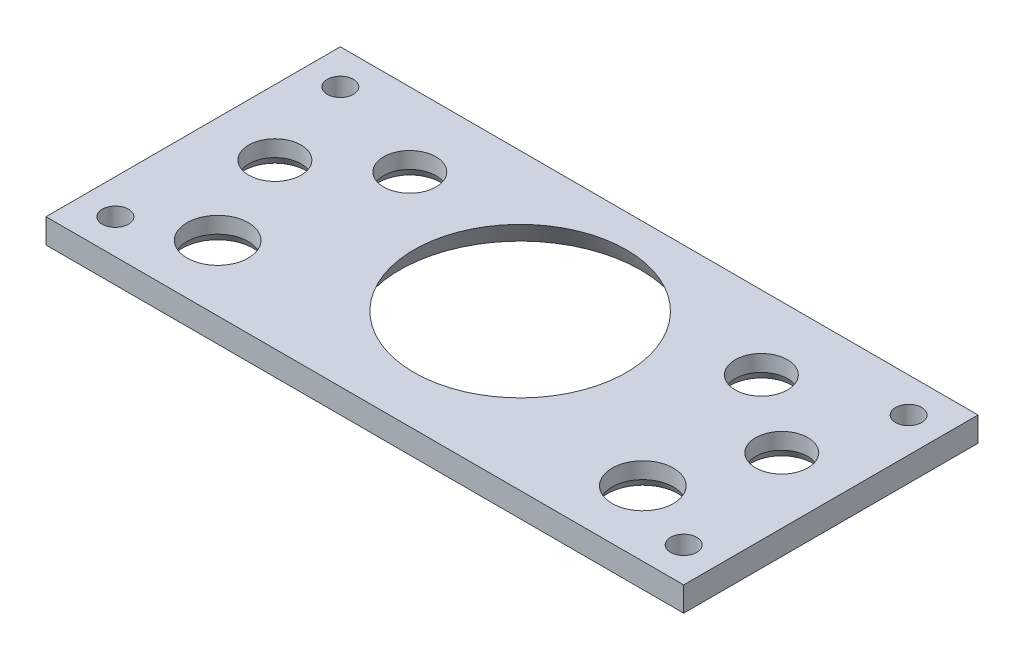
ISO-10303-21;
HEADER;
FILE_DESCRIPTION(('STEP AP214'),'2;1');
FILE_NAME('part.step','',(''),(''),'','','');
FILE_SCHEMA(('AUTOMOTIVE_DESIGN { 1 0 10303 214 1 1 1 1 }'));
ENDSEC;
DATA;
#1=APPLICATION_CONTEXT('core data for automotive mechanical design processes');
#2=APPLICATION_PROTOCOL_DEFINITION('international standard','automotive_design',2000,#1);
#3=PRODUCT_CONTEXT('',#1,'mechanical');
#4=PRODUCT('Part','Part','',(#3));
#5=PRODUCT_RELATED_PRODUCT_CATEGORY('part','',(#4));
#6=PRODUCT_DEFINITION_FORMATION('','',#4);
#7=PRODUCT_DEFINITION_CONTEXT('part definition',#1,'design');
#8=PRODUCT_DEFINITION('design','',#6,#7);
#9=PRODUCT_DEFINITION_SHAPE('','',#8);
#10=(LENGTH_UNIT() NAMED_UNIT(*) SI_UNIT(.MILLI.,.METRE.));
#11=(NAMED_UNIT(*) PLANE_ANGLE_UNIT() SI_UNIT($,.RADIAN.));
#12=(NAMED_UNIT(*) SI_UNIT($,.STERADIAN.) SOLID_ANGLE_UNIT());
#13=UNCERTAINTY_MEASURE_WITH_UNIT(LENGTH_MEASURE(1.E-05),#10,'distance_accuracy_value','');
#14=(GEOMETRIC_REPRESENTATION_CONTEXT(3) GLOBAL_UNCERTAINTY_ASSIGNED_CONTEXT((#13)) GLOBAL_UNIT_ASSIGNED_CONTEXT((#10,
#11,#12)) REPRESENTATION_CONTEXT('',''));
#15=CARTESIAN_POINT('',(0.,0.,0.));
#16=DIRECTION('',(0.,0.,1.));
#17=DIRECTION('',(1.,0.,0.));
#18=AXIS2_PLACEMENT_3D('',#15,#16,#17);
#19=CARTESIAN_POINT('',(0.,3.,0.));
#20=DIRECTION('',(0.,1.,0.));
#21=DIRECTION('',(0.,0.,1.));
#22=AXIS2_PLACEMENT_3D('',#19,#20,#21);
#23=PLANE('',#22);
#24=CARTESIAN_POINT('',(-34.7573593128807,3.,-13.7573593128806));
#25=DIRECTION('',(0.,1.,0.));
#26=DIRECTION('',(0.,0.,1.));
#27=AXIS2_PLACEMENT_3D('',#24,#25,#26);
#28=CIRCLE('',#27,1.6);
#29=CARTESIAN_POINT('',(-34.7573593128807,3.,-12.1573593128806));
#30=VERTEX_POINT('',#29);
#31=EDGE_CURVE('E228',#30,#30,#28,.T.);
#32=ORIENTED_EDGE('',*,*,#31,.F.);
#33=EDGE_LOOP('',(#32));
#34=FACE_BOUND('',#33,.T.);
#35=CARTESIAN_POINT('',(34.7573593128807,3.,-13.7573593128806));
#36=DIRECTION('',(0.,1.,0.));
#37=DIRECTION('',(0.,0.,1.));
#38=AXIS2_PLACEMENT_3D('',#35,#36,#37);
#39=CIRCLE('',#38,1.6);
#40=CARTESIAN_POINT('',(34.7573593128807,3.,-12.1573593128807));
#41=VERTEX_POINT('',#40);
#42=EDGE_CURVE('E234',#41,#41,#39,.T.);
#43=ORIENTED_EDGE('',*,*,#42,.F.);
#44=EDGE_LOOP('',(#43));
#45=FACE_BOUND('',#44,.T.);
#46=CARTESIAN_POINT('',(34.7573593128807,3.,13.7573593128807));
#47=DIRECTION('',(0.,1.,0.));
#48=DIRECTION('',(0.,0.,1.));
#49=AXIS2_PLACEMENT_3D('',#46,#47,#48);
#50=CIRCLE('',#49,1.6);
#51=CARTESIAN_POINT('',(34.7573593128807,3.,15.3573593128807));
#52=VERTEX_POINT('',#51);
#53=EDGE_CURVE('E242',#52,#52,#50,.T.);
#54=ORIENTED_EDGE('',*,*,#53,.F.);
#55=EDGE_LOOP('',(#54));
#56=FACE_BOUND('',#55,.T.);
#57=CARTESIAN_POINT('',(-34.7573593128807,3.,13.7573593128807));
#58=DIRECTION('',(0.,1.,0.));
#59=DIRECTION('',(0.,0.,1.));
#60=AXIS2_PLACEMENT_3D('',#57,#58,#59);
#61=CIRCLE('',#60,1.6);
#62=CARTESIAN_POINT('',(-34.7573593128807,3.,15.3573593128807));
#63=VERTEX_POINT('',#62);
#64=EDGE_CURVE('E231',#63,#63,#61,.T.);
#65=ORIENTED_EDGE('',*,*,#64,.F.);
#66=EDGE_LOOP('',(#65));
#67=FACE_BOUND('',#66,.T.);
#68=CARTESIAN_POINT('',(21.5,3.,-9.));
#69=DIRECTION('',(0.,1.,0.));
#70=DIRECTION('',(0.,0.,1.));
#71=AXIS2_PLACEMENT_3D('',#68,#69,#70);
#72=CIRCLE('',#71,3.2);
#73=CARTESIAN_POINT('',(21.5,3.,-5.8));
#74=VERTEX_POINT('',#73);
#75=EDGE_CURVE('E253',#74,#74,#72,.T.);
#76=ORIENTED_EDGE('',*,*,#75,.F.);
#77=EDGE_LOOP('',(#76));
#78=FACE_BOUND('',#77,.T.);
#79=CARTESIAN_POINT('',(26.,3.,10.));
#80=DIRECTION('',(0.,1.,0.));
#81=DIRECTION('',(0.,0.,1.));
#82=AXIS2_PLACEMENT_3D('',#79,#80,#81);
#83=CIRCLE('',#82,3.75000000000001);
#84=CARTESIAN_POINT('',(26.,3.,13.75));
#85=VERTEX_POINT('',#84);
#86=EDGE_CURVE('E259',#85,#85,#83,.T.);
#87=ORIENTED_EDGE('',*,*,#86,.F.);
#88=EDGE_LOOP('',(#87));
#89=FACE_BOUND('',#88,.T.);
#90=CARTESIAN_POINT('',(-26.,3.,10.));
#91=DIRECTION('',(0.,1.,0.));
#92=DIRECTION('',(0.,0.,1.));
#93=AXIS2_PLACEMENT_3D('',#90,#91,#92);
#94=CIRCLE('',#93,3.75);
#95=CARTESIAN_POINT('',(-26.,3.,13.75));
#96=VERTEX_POINT('',#95);
#97=EDGE_CURVE('E265',#96,#96,#94,.T.);
#98=ORIENTED_EDGE('',*,*,#97,.F.);
#99=EDGE_LOOP('',(#98));
#100=FACE_BOUND('',#99,.T.);
#101=DIRECTION('',(0.,0.,1.));
#102=VECTOR('',#101,1.);
#103=CARTESIAN_POINT('',(-39.,3.,18.));
#104=LINE('',#103,#102);
#105=CARTESIAN_POINT('',(-39.,3.,-18.));
#106=VERTEX_POINT('',#105);
#107=CARTESIAN_POINT('',(-39.,3.,18.));
#108=VERTEX_POINT('',#107);
#109=EDGE_CURVE('E87',#106,#108,#104,.T.);
#110=ORIENTED_EDGE('',*,*,#109,.T.);
#111=DIRECTION('',(1.,0.,0.));
#112=VECTOR('',#111,1.);
#113=CARTESIAN_POINT('',(39.,3.,18.));
#114=LINE('',#113,#112);
#115=CARTESIAN_POINT('',(39.,3.,18.));
#116=VERTEX_POINT('',#115);
#117=EDGE_CURVE('E82',#108,#116,#114,.T.);
#118=ORIENTED_EDGE('',*,*,#117,.T.);
#119=DIRECTION('',(0.,0.,-1.));
#120=VECTOR('',#119,1.);
#121=CARTESIAN_POINT('',(39.,3.,18.));
#122=LINE('',#121,#120);
#123=CARTESIAN_POINT('',(39.,3.,-18.));
#124=VERTEX_POINT('',#123);
#125=EDGE_CURVE('E85',#116,#124,#122,.T.);
#126=ORIENTED_EDGE('',*,*,#125,.T.);
#127=DIRECTION('',(-1.,0.,0.));
#128=VECTOR('',#127,1.);
#129=CARTESIAN_POINT('',(39.,3.,-18.));
#130=LINE('',#129,#128);
#131=EDGE_CURVE('E51',#124,#106,#130,.T.);
#132=ORIENTED_EDGE('',*,*,#131,.T.);
#133=EDGE_LOOP('',(#110,#118,#126,#132));
#134=FACE_BOUND('',#133,.T.);
#135=CARTESIAN_POINT('',(-31.,3.,-2.));
#136=DIRECTION('',(0.,1.,0.));
#137=DIRECTION('',(0.,0.,1.));
#138=AXIS2_PLACEMENT_3D('',#135,#136,#137);
#139=CIRCLE('',#138,3.2);
#140=CARTESIAN_POINT('',(-31.,3.,1.2));
#141=VERTEX_POINT('',#140);
#142=EDGE_CURVE('E105',#141,#141,#139,.T.);
#143=ORIENTED_EDGE('',*,*,#142,.F.);
#144=EDGE_LOOP('',(#143));
#145=FACE_BOUND('',#144,.T.);
#146=CARTESIAN_POINT('',(31.,3.,-2.));
#147=DIRECTION('',(0.,1.,0.));
#148=DIRECTION('',(0.,0.,1.));
#149=AXIS2_PLACEMENT_3D('',#146,#147,#148);
#150=CIRCLE('',#149,3.20000000000001);
#151=CARTESIAN_POINT('',(31.,3.,1.20000000000001));
#152=VERTEX_POINT('',#151);
#153=EDGE_CURVE('E262',#152,#152,#150,.T.);
#154=ORIENTED_EDGE('',*,*,#153,.F.);
#155=EDGE_LOOP('',(#154));
#156=FACE_BOUND('',#155,.T.);
#157=CARTESIAN_POINT('',(0.,3.,-1.));
#158=DIRECTION('',(0.,1.,0.));
#159=DIRECTION('',(0.,0.,1.));
#160=AXIS2_PLACEMENT_3D('',#157,#158,#159);
#161=CIRCLE('',#160,13.);
#162=CARTESIAN_POINT('',(0.,3.,12.));
#163=VERTEX_POINT('',#162);
#164=EDGE_CURVE('E256',#163,#163,#161,.T.);
#165=ORIENTED_EDGE('',*,*,#164,.F.);
#166=EDGE_LOOP('',(#165));
#167=FACE_BOUND('',#166,.T.);
#168=CARTESIAN_POINT('',(-21.5,3.,-9.));
#169=DIRECTION('',(0.,1.,0.));
#170=DIRECTION('',(0.,0.,1.));
#171=AXIS2_PLACEMENT_3D('',#168,#169,#170);
#172=CIRCLE('',#171,3.2);
#173=CARTESIAN_POINT('',(-21.5,3.,-5.8));
#174=VERTEX_POINT('',#173);
#175=EDGE_CURVE('E248',#174,#174,#172,.T.);
#176=ORIENTED_EDGE('',*,*,#175,.F.);
#177=EDGE_LOOP('',(#176));
#178=FACE_BOUND('',#177,.T.);
#179=ADVANCED_FACE('F34',(#34,#45,#56,#67,#78,#89,#100,#134,#145,#156,#167,#178),#23,.T.);
#180=CARTESIAN_POINT('',(0.,0.,0.));
#181=DIRECTION('',(0.,1.,0.));
#182=DIRECTION('',(0.,0.,1.));
#183=AXIS2_PLACEMENT_3D('',#180,#181,#182);
#184=PLANE('',#183);
#185=CARTESIAN_POINT('',(-34.7573593128807,0.,-13.7573593128806));
#186=DIRECTION('',(0.,1.,0.));
#187=DIRECTION('',(0.,0.,1.));
#188=AXIS2_PLACEMENT_3D('',#185,#186,#187);
#189=CIRCLE('',#188,1.6);
#190=CARTESIAN_POINT('',(-34.7573593128807,0.,-12.1573593128806));
#191=VERTEX_POINT('',#190);
#192=EDGE_CURVE('E226',#191,#191,#189,.T.);
#193=ORIENTED_EDGE('',*,*,#192,.T.);
#194=EDGE_LOOP('',(#193));
#195=FACE_BOUND('',#194,.T.);
#196=CARTESIAN_POINT('',(34.7573593128807,0.,-13.7573593128806));
#197=DIRECTION('',(0.,1.,0.));
#198=DIRECTION('',(0.,0.,1.));
#199=AXIS2_PLACEMENT_3D('',#196,#197,#198);
#200=CIRCLE('',#199,1.6);
#201=CARTESIAN_POINT('',(34.7573593128807,0.,-12.1573593128807));
#202=VERTEX_POINT('',#201);
#203=EDGE_CURVE('E229',#202,#202,#200,.T.);
#204=ORIENTED_EDGE('',*,*,#203,.T.);
#205=EDGE_LOOP('',(#204));
#206=FACE_BOUND('',#205,.T.);
#207=CARTESIAN_POINT('',(34.7573593128807,0.,13.7573593128807));
#208=DIRECTION('',(0.,1.,0.));
#209=DIRECTION('',(0.,0.,1.));
#210=AXIS2_PLACEMENT_3D('',#207,#208,#209);
#211=CIRCLE('',#210,1.6);
#212=CARTESIAN_POINT('',(34.7573593128807,0.,15.3573593128807));
#213=VERTEX_POINT('',#212);
#214=EDGE_CURVE('E239',#213,#213,#211,.T.);
#215=ORIENTED_EDGE('',*,*,#214,.T.);
#216=EDGE_LOOP('',(#215));
#217=FACE_BOUND('',#216,.T.);
#218=CARTESIAN_POINT('',(-34.7573593128807,0.,13.7573593128807));
#219=DIRECTION('',(0.,1.,0.));
#220=DIRECTION('',(0.,0.,1.));
#221=AXIS2_PLACEMENT_3D('',#218,#219,#220);
#222=CIRCLE('',#221,1.6);
#223=CARTESIAN_POINT('',(-34.7573593128807,0.,15.3573593128807));
#224=VERTEX_POINT('',#223);
#225=EDGE_CURVE('E245',#224,#224,#222,.T.);
#226=ORIENTED_EDGE('',*,*,#225,.T.);
#227=EDGE_LOOP('',(#226));
#228=FACE_BOUND('',#227,.T.);
#229=CARTESIAN_POINT('',(-26.,0.,10.));
#230=DIRECTION('',(0.,1.,0.));
#231=DIRECTION('',(0.,0.,1.));
#232=AXIS2_PLACEMENT_3D('',#229,#230,#231);
#233=CIRCLE('',#232,4.32735026918962);
#234=CARTESIAN_POINT('',(-26.,0.,14.3273502691896));
#235=VERTEX_POINT('',#234);
#236=EDGE_CURVE('E130',#235,#235,#233,.T.);
#237=ORIENTED_EDGE('',*,*,#236,.T.);
#238=EDGE_LOOP('',(#237));
#239=FACE_BOUND('',#238,.T.);
#240=CARTESIAN_POINT('',(-21.5,0.,-9.));
#241=DIRECTION('',(0.,1.,0.));
#242=DIRECTION('',(0.,0.,1.));
#243=AXIS2_PLACEMENT_3D('',#240,#241,#242);
#244=CIRCLE('',#243,3.77735026918964);
#245=CARTESIAN_POINT('',(-21.5,0.,-5.22264973081036));
#246=VERTEX_POINT('',#245);
#247=EDGE_CURVE('E127',#246,#246,#244,.T.);
#248=ORIENTED_EDGE('',*,*,#247,.T.);
#249=EDGE_LOOP('',(#248));
#250=FACE_BOUND('',#249,.T.);
#251=CARTESIAN_POINT('',(21.5,0.,-9.));
#252=DIRECTION('',(0.,1.,0.));
#253=DIRECTION('',(0.,0.,1.));
#254=AXIS2_PLACEMENT_3D('',#251,#252,#253);
#255=CIRCLE('',#254,3.77735026918964);
#256=CARTESIAN_POINT('',(21.5,0.,-5.22264973081036));
#257=VERTEX_POINT('',#256);
#258=EDGE_CURVE('E124',#257,#257,#255,.T.);
#259=ORIENTED_EDGE('',*,*,#258,.T.);
#260=EDGE_LOOP('',(#259));
#261=FACE_BOUND('',#260,.T.);
#262=CARTESIAN_POINT('',(-31.,0.,-2.));
#263=DIRECTION('',(0.,1.,0.));
#264=DIRECTION('',(0.,0.,1.));
#265=AXIS2_PLACEMENT_3D('',#262,#263,#264);
#266=CIRCLE('',#265,3.77735026918964);
#267=CARTESIAN_POINT('',(-31.,0.,1.77735026918964));
#268=VERTEX_POINT('',#267);
#269=EDGE_CURVE('E121',#268,#268,#266,.T.);
#270=ORIENTED_EDGE('',*,*,#269,.T.);
#271=EDGE_LOOP('',(#270));
#272=FACE_BOUND('',#271,.T.);
#273=CARTESIAN_POINT('',(31.,0.,-2.));
#274=DIRECTION('',(0.,1.,0.));
#275=DIRECTION('',(0.,0.,1.));
#276=AXIS2_PLACEMENT_3D('',#273,#274,#275);
#277=CIRCLE('',#276,3.77735026918964);
#278=CARTESIAN_POINT('',(31.,0.,1.77735026918964));
#279=VERTEX_POINT('',#278);
#280=EDGE_CURVE('E118',#279,#279,#277,.T.);
#281=ORIENTED_EDGE('',*,*,#280,.T.);
#282=EDGE_LOOP('',(#281));
#283=FACE_BOUND('',#282,.T.);
#284=CARTESIAN_POINT('',(26.,0.,10.));
#285=DIRECTION('',(0.,1.,0.));
#286=DIRECTION('',(0.,0.,1.));
#287=AXIS2_PLACEMENT_3D('',#284,#285,#286);
#288=CIRCLE('',#287,4.32735026918964);
#289=CARTESIAN_POINT('',(26.,0.,14.3273502691896));
#290=VERTEX_POINT('',#289);
#291=EDGE_CURVE('E115',#290,#290,#288,.T.);
#292=ORIENTED_EDGE('',*,*,#291,.T.);
#293=EDGE_LOOP('',(#292));
#294=FACE_BOUND('',#293,.T.);
#295=CARTESIAN_POINT('',(0.,0.,-1.));
#296=DIRECTION('',(0.,1.,0.));
#297=DIRECTION('',(0.,0.,1.));
#298=AXIS2_PLACEMENT_3D('',#295,#296,#297);
#299=CIRCLE('',#298,14.7320508075689);
#300=CARTESIAN_POINT('',(0.,0.,13.7320508075689));
#301=VERTEX_POINT('',#300);
#302=EDGE_CURVE('E112',#301,#301,#299,.T.);
#303=ORIENTED_EDGE('',*,*,#302,.T.);
#304=EDGE_LOOP('',(#303));
#305=FACE_BOUND('',#304,.T.);
#306=DIRECTION('',(0.,0.,1.));
#307=VECTOR('',#306,1.);
#308=CARTESIAN_POINT('',(-39.,0.,18.));
#309=LINE('',#308,#307);
#310=CARTESIAN_POINT('',(-39.,0.,-18.));
#311=VERTEX_POINT('',#310);
#312=CARTESIAN_POINT('',(-39.,0.,18.));
#313=VERTEX_POINT('',#312);
#314=EDGE_CURVE('E102',#311,#313,#309,.T.);
#315=ORIENTED_EDGE('',*,*,#314,.F.);
#316=DIRECTION('',(-1.,0.,0.));
#317=VECTOR('',#316,1.);
#318=CARTESIAN_POINT('',(39.,0.,-18.));
#319=LINE('',#318,#317);
#320=CARTESIAN_POINT('',(39.,0.,-18.));
#321=VERTEX_POINT('',#320);
#322=EDGE_CURVE('E74',#321,#311,#319,.T.);
#323=ORIENTED_EDGE('',*,*,#322,.F.);
#324=DIRECTION('',(0.,0.,-1.));
#325=VECTOR('',#324,1.);
#326=CARTESIAN_POINT('',(39.,0.,18.));
#327=LINE('',#326,#325);
#328=CARTESIAN_POINT('',(39.,0.,18.));
#329=VERTEX_POINT('',#328);
#330=EDGE_CURVE('E68',#329,#321,#327,.T.);
#331=ORIENTED_EDGE('',*,*,#330,.F.);
#332=DIRECTION('',(1.,0.,0.));
#333=VECTOR('',#332,1.);
#334=CARTESIAN_POINT('',(39.,0.,18.));
#335=LINE('',#334,#333);
#336=EDGE_CURVE('E92',#313,#329,#335,.T.);
#337=ORIENTED_EDGE('',*,*,#336,.F.);
#338=EDGE_LOOP('',(#315,#323,#331,#337));
#339=FACE_BOUND('',#338,.T.);
#340=ADVANCED_FACE('F156',(#195,#206,#217,#228,#239,#250,#261,#272,#283,#294,#305,#339),#184,.F.);
#341=CARTESIAN_POINT('',(-39.,3.,18.));
#342=DIRECTION('',(1.,0.,0.));
#343=DIRECTION('',(0.,0.,-1.));
#344=AXIS2_PLACEMENT_3D('',#341,#342,#343);
#345=PLANE('',#344);
#346=ORIENTED_EDGE('',*,*,#314,.T.);
#347=DIRECTION('',(0.,-1.,0.));
#348=VECTOR('',#347,1.);
#349=CARTESIAN_POINT('',(-39.,3.,18.));
#350=LINE('',#349,#348);
#351=EDGE_CURVE('E93',#108,#313,#350,.T.);
#352=ORIENTED_EDGE('',*,*,#351,.F.);
#353=ORIENTED_EDGE('',*,*,#109,.F.);
#354=DIRECTION('',(0.,-1.,0.));
#355=VECTOR('',#354,1.);
#356=CARTESIAN_POINT('',(-39.,3.,-18.));
#357=LINE('',#356,#355);
#358=EDGE_CURVE('E98',#106,#311,#357,.T.);
#359=ORIENTED_EDGE('',*,*,#358,.T.);
#360=EDGE_LOOP('',(#346,#352,#353,#359));
#361=FACE_BOUND('',#360,.T.);
#362=ADVANCED_FACE('F159',(#361),#345,.F.);
#363=CARTESIAN_POINT('',(39.,3.,18.));
#364=DIRECTION('',(0.,0.,-1.));
#365=DIRECTION('',(-1.,0.,0.));
#366=AXIS2_PLACEMENT_3D('',#363,#364,#365);
#367=PLANE('',#366);
#368=ORIENTED_EDGE('',*,*,#336,.T.);
#369=DIRECTION('',(0.,-1.,0.));
#370=VECTOR('',#369,1.);
#371=CARTESIAN_POINT('',(39.,3.,18.));
#372=LINE('',#371,#370);
#373=EDGE_CURVE('E90',#116,#329,#372,.T.);
#374=ORIENTED_EDGE('',*,*,#373,.F.);
#375=ORIENTED_EDGE('',*,*,#117,.F.);
#376=ORIENTED_EDGE('',*,*,#351,.T.);
#377=EDGE_LOOP('',(#368,#374,#375,#376));
#378=FACE_BOUND('',#377,.T.);
#379=ADVANCED_FACE('F91',(#378),#367,.F.);
#380=CARTESIAN_POINT('',(39.,3.,18.));
#381=DIRECTION('',(-1.,0.,0.));
#382=DIRECTION('',(0.,0.,1.));
#383=AXIS2_PLACEMENT_3D('',#380,#381,#382);
#384=PLANE('',#383);
#385=ORIENTED_EDGE('',*,*,#330,.T.);
#386=DIRECTION('',(0.,-1.,0.));
#387=VECTOR('',#386,1.);
#388=CARTESIAN_POINT('',(39.,3.,-18.));
#389=LINE('',#388,#387);
#390=EDGE_CURVE('E94',#124,#321,#389,.T.);
#391=ORIENTED_EDGE('',*,*,#390,.F.);
#392=ORIENTED_EDGE('',*,*,#125,.F.);
#393=ORIENTED_EDGE('',*,*,#373,.T.);
#394=EDGE_LOOP('',(#385,#391,#392,#393));
#395=FACE_BOUND('',#394,.T.);
#396=ADVANCED_FACE('F96',(#395),#384,.F.);
#397=CARTESIAN_POINT('',(39.,3.,-18.));
#398=DIRECTION('',(0.,0.,1.));
#399=DIRECTION('',(1.,0.,0.));
#400=AXIS2_PLACEMENT_3D('',#397,#398,#399);
#401=PLANE('',#400);
#402=ORIENTED_EDGE('',*,*,#322,.T.);
#403=ORIENTED_EDGE('',*,*,#358,.F.);
#404=ORIENTED_EDGE('',*,*,#131,.F.);
#405=ORIENTED_EDGE('',*,*,#390,.T.);
#406=EDGE_LOOP('',(#402,#403,#404,#405));
#407=FACE_BOUND('',#406,.T.);
#408=ADVANCED_FACE('F168',(#407),#401,.F.);
#409=CARTESIAN_POINT('',(-31.,3.,-2.));
#410=DIRECTION('',(0.,-1.,0.));
#411=DIRECTION('',(0.,0.,-1.));
#412=AXIS2_PLACEMENT_3D('',#409,#410,#411);
#413=CYLINDRICAL_SURFACE('',#412,3.2);
#414=CARTESIAN_POINT('',(-31.,1.00000000000002,-2.));
#415=DIRECTION('',(0.,1.,0.));
#416=DIRECTION('',(0.,0.,1.));
#417=AXIS2_PLACEMENT_3D('',#414,#415,#416);
#418=CIRCLE('',#417,3.2);
#419=CARTESIAN_POINT('',(-31.,1.00000000000002,1.2));
#420=VERTEX_POINT('',#419);
#421=EDGE_CURVE('E142',#420,#420,#418,.F.);
#422=ORIENTED_EDGE('',*,*,#421,.T.);
#423=EDGE_LOOP('',(#422));
#424=FACE_BOUND('',#423,.T.);
#425=ORIENTED_EDGE('',*,*,#142,.T.);
#426=EDGE_LOOP('',(#425));
#427=FACE_BOUND('',#426,.T.);
#428=ADVANCED_FACE('F170',(#424,#427),#413,.F.);
#429=CARTESIAN_POINT('',(-26.,3.,10.));
#430=DIRECTION('',(0.,-1.,0.));
#431=DIRECTION('',(0.,0.,-1.));
#432=AXIS2_PLACEMENT_3D('',#429,#430,#431);
#433=CYLINDRICAL_SURFACE('',#432,3.75);
#434=CARTESIAN_POINT('',(-26.,0.999999999999997,10.));
#435=DIRECTION('',(0.,1.,0.));
#436=DIRECTION('',(0.,0.,1.));
#437=AXIS2_PLACEMENT_3D('',#434,#435,#436);
#438=CIRCLE('',#437,3.75);
#439=CARTESIAN_POINT('',(-26.,0.999999999999997,13.75));
#440=VERTEX_POINT('',#439);
#441=EDGE_CURVE('E133',#440,#440,#438,.F.);
#442=ORIENTED_EDGE('',*,*,#441,.T.);
#443=EDGE_LOOP('',(#442));
#444=FACE_BOUND('',#443,.T.);
#445=ORIENTED_EDGE('',*,*,#97,.T.);
#446=EDGE_LOOP('',(#445));
#447=FACE_BOUND('',#446,.T.);
#448=ADVANCED_FACE('F176',(#444,#447),#433,.F.);
#449=CARTESIAN_POINT('',(31.,3.,-2.));
#450=DIRECTION('',(0.,-1.,0.));
#451=DIRECTION('',(0.,0.,-1.));
#452=AXIS2_PLACEMENT_3D('',#449,#450,#451);
#453=CYLINDRICAL_SURFACE('',#452,3.20000000000001);
#454=CARTESIAN_POINT('',(31.,1.00000000000002,-2.));
#455=DIRECTION('',(0.,1.,0.));
#456=DIRECTION('',(0.,0.,1.));
#457=AXIS2_PLACEMENT_3D('',#454,#455,#456);
#458=CIRCLE('',#457,3.20000000000001);
#459=CARTESIAN_POINT('',(31.,1.00000000000002,1.20000000000001));
#460=VERTEX_POINT('',#459);
#461=EDGE_CURVE('E43',#460,#460,#458,.F.);
#462=ORIENTED_EDGE('',*,*,#461,.T.);
#463=EDGE_LOOP('',(#462));
#464=FACE_BOUND('',#463,.T.);
#465=ORIENTED_EDGE('',*,*,#153,.T.);
#466=EDGE_LOOP('',(#465));
#467=FACE_BOUND('',#466,.T.);
#468=ADVANCED_FACE('F147',(#464,#467),#453,.F.);
#469=CARTESIAN_POINT('',(26.,3.,10.));
#470=DIRECTION('',(0.,-1.,0.));
#471=DIRECTION('',(0.,0.,-1.));
#472=AXIS2_PLACEMENT_3D('',#469,#470,#471);
#473=CYLINDRICAL_SURFACE('',#472,3.75000000000001);
#474=CARTESIAN_POINT('',(26.,1.00000000000001,10.));
#475=DIRECTION('',(0.,1.,0.));
#476=DIRECTION('',(0.,0.,1.));
#477=AXIS2_PLACEMENT_3D('',#474,#475,#476);
#478=CIRCLE('',#477,3.75000000000001);
#479=CARTESIAN_POINT('',(26.,1.00000000000001,13.75));
#480=VERTEX_POINT('',#479);
#481=EDGE_CURVE('E11',#480,#480,#478,.F.);
#482=ORIENTED_EDGE('',*,*,#481,.T.);
#483=EDGE_LOOP('',(#482));
#484=FACE_BOUND('',#483,.T.);
#485=ORIENTED_EDGE('',*,*,#86,.T.);
#486=EDGE_LOOP('',(#485));
#487=FACE_BOUND('',#486,.T.);
#488=ADVANCED_FACE('F193',(#484,#487),#473,.F.);
#489=CARTESIAN_POINT('',(21.5,3.,-9.));
#490=DIRECTION('',(0.,-1.,0.));
#491=DIRECTION('',(0.,0.,-1.));
#492=AXIS2_PLACEMENT_3D('',#489,#490,#491);
#493=CYLINDRICAL_SURFACE('',#492,3.2);
#494=CARTESIAN_POINT('',(21.5,1.00000000000002,-9.));
#495=DIRECTION('',(0.,1.,0.));
#496=DIRECTION('',(0.,0.,1.));
#497=AXIS2_PLACEMENT_3D('',#494,#495,#496);
#498=CIRCLE('',#497,3.2);
#499=CARTESIAN_POINT('',(21.5,1.00000000000002,-5.8));
#500=VERTEX_POINT('',#499);
#501=EDGE_CURVE('E139',#500,#500,#498,.F.);
#502=ORIENTED_EDGE('',*,*,#501,.T.);
#503=EDGE_LOOP('',(#502));
#504=FACE_BOUND('',#503,.T.);
#505=ORIENTED_EDGE('',*,*,#75,.T.);
#506=EDGE_LOOP('',(#505));
#507=FACE_BOUND('',#506,.T.);
#508=ADVANCED_FACE('F196',(#504,#507),#493,.F.);
#509=CARTESIAN_POINT('',(-21.5,3.,-9.));
#510=DIRECTION('',(0.,-1.,0.));
#511=DIRECTION('',(0.,0.,-1.));
#512=AXIS2_PLACEMENT_3D('',#509,#510,#511);
#513=CYLINDRICAL_SURFACE('',#512,3.2);
#514=CARTESIAN_POINT('',(-21.5,1.00000000000002,-9.));
#515=DIRECTION('',(0.,1.,0.));
#516=DIRECTION('',(0.,0.,1.));
#517=AXIS2_PLACEMENT_3D('',#514,#515,#516);
#518=CIRCLE('',#517,3.2);
#519=CARTESIAN_POINT('',(-21.5,1.00000000000002,-5.8));
#520=VERTEX_POINT('',#519);
#521=EDGE_CURVE('E136',#520,#520,#518,.F.);
#522=ORIENTED_EDGE('',*,*,#521,.T.);
#523=EDGE_LOOP('',(#522));
#524=FACE_BOUND('',#523,.T.);
#525=ORIENTED_EDGE('',*,*,#175,.T.);
#526=EDGE_LOOP('',(#525));
#527=FACE_BOUND('',#526,.T.);
#528=ADVANCED_FACE('F200',(#524,#527),#513,.F.);
#529=CARTESIAN_POINT('',(0.,0.,-1.));
#530=DIRECTION('',(0.,-1.,0.));
#531=DIRECTION('',(0.,0.,-1.));
#532=AXIS2_PLACEMENT_3D('',#529,#530,#531);
#533=CONICAL_SURFACE('',#532,14.7320508075689,0.523598775598297);
#534=ORIENTED_EDGE('',*,*,#164,.T.);
#535=EDGE_LOOP('',(#534));
#536=FACE_BOUND('',#535,.T.);
#537=ORIENTED_EDGE('',*,*,#302,.F.);
#538=EDGE_LOOP('',(#537));
#539=FACE_BOUND('',#538,.T.);
#540=ADVANCED_FACE('F204',(#536,#539),#533,.F.);
#541=CARTESIAN_POINT('',(-26.,0.,10.));
#542=DIRECTION('',(0.,-1.,0.));
#543=DIRECTION('',(0.,0.,-1.));
#544=AXIS2_PLACEMENT_3D('',#541,#542,#543);
#545=CONICAL_SURFACE('',#544,4.32735026918962,0.523598775598298);
#546=ORIENTED_EDGE('',*,*,#441,.F.);
#547=EDGE_LOOP('',(#546));
#548=FACE_BOUND('',#547,.T.);
#549=ORIENTED_EDGE('',*,*,#236,.F.);
#550=EDGE_LOOP('',(#549));
#551=FACE_BOUND('',#550,.T.);
#552=ADVANCED_FACE('F281',(#548,#551),#545,.F.);
#553=CARTESIAN_POINT('',(-21.5,0.,-9.));
#554=DIRECTION('',(0.,-1.,0.));
#555=DIRECTION('',(0.,0.,-1.));
#556=AXIS2_PLACEMENT_3D('',#553,#554,#555);
#557=CONICAL_SURFACE('',#556,3.77735026918964,0.523598775598298);
#558=ORIENTED_EDGE('',*,*,#521,.F.);
#559=EDGE_LOOP('',(#558));
#560=FACE_BOUND('',#559,.T.);
#561=ORIENTED_EDGE('',*,*,#247,.F.);
#562=EDGE_LOOP('',(#561));
#563=FACE_BOUND('',#562,.T.);
#564=ADVANCED_FACE('F286',(#560,#563),#557,.F.);
#565=CARTESIAN_POINT('',(21.5,0.,-9.));
#566=DIRECTION('',(0.,-1.,0.));
#567=DIRECTION('',(0.,0.,-1.));
#568=AXIS2_PLACEMENT_3D('',#565,#566,#567);
#569=CONICAL_SURFACE('',#568,3.77735026918964,0.523598775598298);
#570=ORIENTED_EDGE('',*,*,#501,.F.);
#571=EDGE_LOOP('',(#570));
#572=FACE_BOUND('',#571,.T.);
#573=ORIENTED_EDGE('',*,*,#258,.F.);
#574=EDGE_LOOP('',(#573));
#575=FACE_BOUND('',#574,.T.);
#576=ADVANCED_FACE('F294',(#572,#575),#569,.F.);
#577=CARTESIAN_POINT('',(-31.,0.,-2.));
#578=DIRECTION('',(0.,-1.,0.));
#579=DIRECTION('',(0.,0.,-1.));
#580=AXIS2_PLACEMENT_3D('',#577,#578,#579);
#581=CONICAL_SURFACE('',#580,3.77735026918964,0.523598775598298);
#582=ORIENTED_EDGE('',*,*,#421,.F.);
#583=EDGE_LOOP('',(#582));
#584=FACE_BOUND('',#583,.T.);
#585=ORIENTED_EDGE('',*,*,#269,.F.);
#586=EDGE_LOOP('',(#585));
#587=FACE_BOUND('',#586,.T.);
#588=ADVANCED_FACE('F153',(#584,#587),#581,.F.);
#589=CARTESIAN_POINT('',(31.,0.,-2.));
#590=DIRECTION('',(0.,-1.,0.));
#591=DIRECTION('',(0.,0.,-1.));
#592=AXIS2_PLACEMENT_3D('',#589,#590,#591);
#593=CONICAL_SURFACE('',#592,3.77735026918964,0.523598775598298);
#594=ORIENTED_EDGE('',*,*,#461,.F.);
#595=EDGE_LOOP('',(#594));
#596=FACE_BOUND('',#595,.T.);
#597=ORIENTED_EDGE('',*,*,#280,.F.);
#598=EDGE_LOOP('',(#597));
#599=FACE_BOUND('',#598,.T.);
#600=ADVANCED_FACE('F150',(#596,#599),#593,.F.);
#601=CARTESIAN_POINT('',(26.,0.,10.));
#602=DIRECTION('',(0.,-1.,0.));
#603=DIRECTION('',(0.,0.,-1.));
#604=AXIS2_PLACEMENT_3D('',#601,#602,#603);
#605=CONICAL_SURFACE('',#604,4.32735026918964,0.523598775598301);
#606=ORIENTED_EDGE('',*,*,#481,.F.);
#607=EDGE_LOOP('',(#606));
#608=FACE_BOUND('',#607,.T.);
#609=ORIENTED_EDGE('',*,*,#291,.F.);
#610=EDGE_LOOP('',(#609));
#611=FACE_BOUND('',#610,.T.);
#612=ADVANCED_FACE('F36',(#608,#611),#605,.F.);
#613=CARTESIAN_POINT('',(-34.7573593128807,0.,13.7573593128807));
#614=DIRECTION('',(0.,1.,0.));
#615=DIRECTION('',(0.,0.,1.));
#616=AXIS2_PLACEMENT_3D('',#613,#614,#615);
#617=CYLINDRICAL_SURFACE('',#616,1.6);
#618=ORIENTED_EDGE('',*,*,#225,.F.);
#619=EDGE_LOOP('',(#618));
#620=FACE_BOUND('',#619,.T.);
#621=ORIENTED_EDGE('',*,*,#64,.T.);
#622=EDGE_LOOP('',(#621));
#623=FACE_BOUND('',#622,.T.);
#624=ADVANCED_FACE('F206',(#620,#623),#617,.F.);
#625=CARTESIAN_POINT('',(34.7573593128807,0.,13.7573593128807));
#626=DIRECTION('',(0.,1.,0.));
#627=DIRECTION('',(0.,0.,1.));
#628=AXIS2_PLACEMENT_3D('',#625,#626,#627);
#629=CYLINDRICAL_SURFACE('',#628,1.6);
#630=ORIENTED_EDGE('',*,*,#214,.F.);
#631=EDGE_LOOP('',(#630));
#632=FACE_BOUND('',#631,.T.);
#633=ORIENTED_EDGE('',*,*,#53,.T.);
#634=EDGE_LOOP('',(#633));
#635=FACE_BOUND('',#634,.T.);
#636=ADVANCED_FACE('F209',(#632,#635),#629,.F.);
#637=CARTESIAN_POINT('',(34.7573593128807,0.,-13.7573593128806));
#638=DIRECTION('',(0.,1.,0.));
#639=DIRECTION('',(0.,0.,1.));
#640=AXIS2_PLACEMENT_3D('',#637,#638,#639);
#641=CYLINDRICAL_SURFACE('',#640,1.6);
#642=ORIENTED_EDGE('',*,*,#203,.F.);
#643=EDGE_LOOP('',(#642));
#644=FACE_BOUND('',#643,.T.);
#645=ORIENTED_EDGE('',*,*,#42,.T.);
#646=EDGE_LOOP('',(#645));
#647=FACE_BOUND('',#646,.T.);
#648=ADVANCED_FACE('F213',(#644,#647),#641,.F.);
#649=CARTESIAN_POINT('',(-34.7573593128807,0.,-13.7573593128806));
#650=DIRECTION('',(0.,1.,0.));
#651=DIRECTION('',(0.,0.,1.));
#652=AXIS2_PLACEMENT_3D('',#649,#650,#651);
#653=CYLINDRICAL_SURFACE('',#652,1.6);
#654=ORIENTED_EDGE('',*,*,#192,.F.);
#655=EDGE_LOOP('',(#654));
#656=FACE_BOUND('',#655,.T.);
#657=ORIENTED_EDGE('',*,*,#31,.T.);
#658=EDGE_LOOP('',(#657));
#659=FACE_BOUND('',#658,.T.);
#660=ADVANCED_FACE('F217',(#656,#659),#653,.F.);
#661=CLOSED_SHELL('',(#179,#340,#362,#379,#396,#408,#428,#448,#468,#488,#508,#528,#540,#552,
#564,#576,#588,#600,#612,#624,#636,#648,#660));
#662=MANIFOLD_SOLID_BREP('B2',#661);
#663=ADVANCED_BREP_SHAPE_REPRESENTATION('',(#18,#662),#14);
#664=SHAPE_DEFINITION_REPRESENTATION(#9,#663);
ENDSEC;
END-ISO-10303-21;
